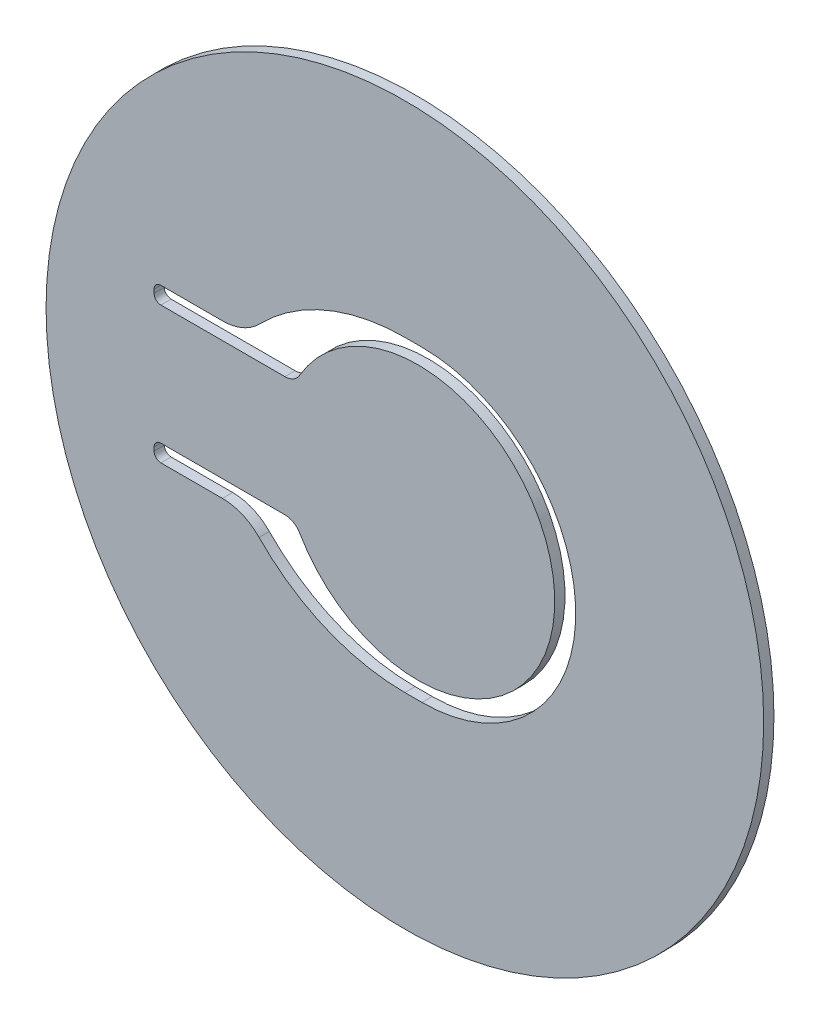
ISO-10303-21;
HEADER;
FILE_DESCRIPTION(('STEP AP214'),'2;1');
FILE_NAME('part.step','',(''),(''),'','','');
FILE_SCHEMA(('AUTOMOTIVE_DESIGN { 1 0 10303 214 1 1 1 1 }'));
ENDSEC;
DATA;
#1=APPLICATION_CONTEXT('core data for automotive mechanical design processes');
#2=APPLICATION_PROTOCOL_DEFINITION('international standard','automotive_design',2000,#1);
#3=PRODUCT_CONTEXT('',#1,'mechanical');
#4=PRODUCT('Part','Part','',(#3));
#5=PRODUCT_RELATED_PRODUCT_CATEGORY('part','',(#4));
#6=PRODUCT_DEFINITION_FORMATION('','',#4);
#7=PRODUCT_DEFINITION_CONTEXT('part definition',#1,'design');
#8=PRODUCT_DEFINITION('design','',#6,#7);
#9=PRODUCT_DEFINITION_SHAPE('','',#8);
#10=(LENGTH_UNIT() NAMED_UNIT(*) SI_UNIT(.MILLI.,.METRE.));
#11=(NAMED_UNIT(*) PLANE_ANGLE_UNIT() SI_UNIT($,.RADIAN.));
#12=(NAMED_UNIT(*) SI_UNIT($,.STERADIAN.) SOLID_ANGLE_UNIT());
#13=UNCERTAINTY_MEASURE_WITH_UNIT(LENGTH_MEASURE(1.E-05),#10,'distance_accuracy_value','');
#14=(GEOMETRIC_REPRESENTATION_CONTEXT(3) GLOBAL_UNCERTAINTY_ASSIGNED_CONTEXT((#13)) GLOBAL_UNIT_ASSIGNED_CONTEXT((#10,
#11,#12)) REPRESENTATION_CONTEXT('',''));
#15=CARTESIAN_POINT('',(0.,0.,0.));
#16=DIRECTION('',(0.,0.,1.));
#17=DIRECTION('',(1.,0.,0.));
#18=AXIS2_PLACEMENT_3D('',#15,#16,#17);
#19=CARTESIAN_POINT('',(0.,0.,-0.3));
#20=DIRECTION('',(0.,0.,1.));
#21=DIRECTION('',(1.,0.,0.));
#22=AXIS2_PLACEMENT_3D('',#19,#20,#21);
#23=CYLINDRICAL_SURFACE('',#22,10.5);
#24=CARTESIAN_POINT('',(0.,0.,-0.3));
#25=DIRECTION('',(0.,0.,1.));
#26=DIRECTION('',(1.,0.,0.));
#27=AXIS2_PLACEMENT_3D('',#24,#25,#26);
#28=CIRCLE('',#27,10.5);
#29=CARTESIAN_POINT('',(10.5,0.,-0.3));
#30=VERTEX_POINT('',#29);
#31=EDGE_CURVE('E11',#30,#30,#28,.T.);
#32=ORIENTED_EDGE('',*,*,#31,.T.);
#33=EDGE_LOOP('',(#32));
#34=FACE_BOUND('',#33,.T.);
#35=CARTESIAN_POINT('',(0.,0.,0.));
#36=DIRECTION('',(0.,0.,1.));
#37=DIRECTION('',(1.,0.,0.));
#38=AXIS2_PLACEMENT_3D('',#35,#36,#37);
#39=CIRCLE('',#38,10.5);
#40=CARTESIAN_POINT('',(10.5,0.,0.));
#41=VERTEX_POINT('',#40);
#42=EDGE_CURVE('E42',#41,#41,#39,.T.);
#43=ORIENTED_EDGE('',*,*,#42,.F.);
#44=EDGE_LOOP('',(#43));
#45=FACE_BOUND('',#44,.T.);
#46=ADVANCED_FACE('F39',(#34,#45),#23,.T.);
#47=CARTESIAN_POINT('',(0.,0.,-0.3));
#48=DIRECTION('',(0.,0.,1.));
#49=DIRECTION('',(1.,0.,0.));
#50=AXIS2_PLACEMENT_3D('',#47,#48,#49);
#51=PLANE('',#50);
#52=CARTESIAN_POINT('',(0.385934296614987,2.59592270811036E-11,-0.3));
#53=DIRECTION('',(0.,0.,-1.));
#54=DIRECTION('',(1.,0.,0.));
#55=AXIS2_PLACEMENT_3D('',#52,#53,#54);
#56=CIRCLE('',#55,4.);
#57=CARTESIAN_POINT('',(-3.07816731852943,2.00000000001442,-0.3));
#58=VERTEX_POINT('',#57);
#59=CARTESIAN_POINT('',(-3.07816731850944,-1.99999999999711,-0.3));
#60=VERTEX_POINT('',#59);
#61=EDGE_CURVE('E183',#58,#60,#56,.T.);
#62=ORIENTED_EDGE('',*,*,#61,.T.);
#63=CARTESIAN_POINT('',(-3.5111800204,-2.25,-0.3));
#64=DIRECTION('',(0.,0.,1.));
#65=DIRECTION('',(1.,0.,0.));
#66=AXIS2_PLACEMENT_3D('',#63,#64,#65);
#67=CIRCLE('',#66,0.500000000000001);
#68=CARTESIAN_POINT('',(-3.5111800204,-1.75,-0.3));
#69=VERTEX_POINT('',#68);
#70=EDGE_CURVE('E177',#60,#69,#67,.T.);
#71=ORIENTED_EDGE('',*,*,#70,.T.);
#72=DIRECTION('',(-1.,0.,0.));
#73=VECTOR('',#72,1.);
#74=CARTESIAN_POINT('',(-3.5111800204,-1.75,-0.3));
#75=LINE('',#74,#73);
#76=CARTESIAN_POINT('',(-7.1395785063,-1.75,-0.3));
#77=VERTEX_POINT('',#76);
#78=EDGE_CURVE('E186',#69,#77,#75,.T.);
#79=ORIENTED_EDGE('',*,*,#78,.T.);
#80=CARTESIAN_POINT('',(-7.1395785063,-1.95,-0.3));
#81=DIRECTION('',(0.,0.,1.));
#82=DIRECTION('',(1.,0.,0.));
#83=AXIS2_PLACEMENT_3D('',#80,#81,#82);
#84=CIRCLE('',#83,0.2);
#85=CARTESIAN_POINT('',(-7.3395785063,-1.95,-0.3));
#86=VERTEX_POINT('',#85);
#87=EDGE_CURVE('E53',#77,#86,#84,.T.);
#88=ORIENTED_EDGE('',*,*,#87,.T.);
#89=DIRECTION('',(0.,-1.,0.));
#90=VECTOR('',#89,1.);
#91=CARTESIAN_POINT('',(-7.3395785063,-1.95,-0.3));
#92=LINE('',#91,#90);
#93=CARTESIAN_POINT('',(-7.3395785063,-2.05,-0.3));
#94=VERTEX_POINT('',#93);
#95=EDGE_CURVE('E201',#86,#94,#92,.T.);
#96=ORIENTED_EDGE('',*,*,#95,.T.);
#97=CARTESIAN_POINT('',(-7.1395785063,-2.05,-0.3));
#98=DIRECTION('',(0.,0.,1.));
#99=DIRECTION('',(1.,0.,0.));
#100=AXIS2_PLACEMENT_3D('',#97,#98,#99);
#101=CIRCLE('',#100,0.2);
#102=CARTESIAN_POINT('',(-7.1395785063,-2.25,-0.3));
#103=VERTEX_POINT('',#102);
#104=EDGE_CURVE('E204',#94,#103,#101,.T.);
#105=ORIENTED_EDGE('',*,*,#104,.T.);
#106=DIRECTION('',(1.,0.,0.));
#107=VECTOR('',#106,1.);
#108=CARTESIAN_POINT('',(-7.1395785063,-2.25,-0.3));
#109=LINE('',#108,#107);
#110=CARTESIAN_POINT('',(-5.33957850633904,-2.25,-0.3));
#111=VERTEX_POINT('',#110);
#112=EDGE_CURVE('E207',#103,#111,#109,.T.);
#113=ORIENTED_EDGE('',*,*,#112,.T.);
#114=CARTESIAN_POINT('',(-5.33957850633904,-3.75,-0.3));
#115=DIRECTION('',(0.,0.,-1.));
#116=DIRECTION('',(1.,0.,0.));
#117=AXIS2_PLACEMENT_3D('',#114,#115,#116);
#118=CIRCLE('',#117,1.5);
#119=CARTESIAN_POINT('',(-4.26605179506636,-2.70236437623377,-0.3));
#120=VERTEX_POINT('',#119);
#121=EDGE_CURVE('E210',#111,#120,#118,.T.);
#122=ORIENTED_EDGE('',*,*,#121,.T.);
#123=CARTESIAN_POINT('',(0.,1.4607996945,-0.3));
#124=DIRECTION('',(0.,0.,1.));
#125=DIRECTION('',(1.,0.,0.));
#126=AXIS2_PLACEMENT_3D('',#123,#124,#125);
#127=CIRCLE('',#126,5.96079969450723);
#128=CARTESIAN_POINT('',(0.,-4.50000000000723,-0.3));
#129=VERTEX_POINT('',#128);
#130=EDGE_CURVE('E213',#120,#129,#127,.T.);
#131=ORIENTED_EDGE('',*,*,#130,.T.);
#132=DIRECTION('',(1.,0.,0.));
#133=VECTOR('',#132,1.);
#134=CARTESIAN_POINT('',(0.,-4.50000000000723,-0.3));
#135=LINE('',#134,#133);
#136=CARTESIAN_POINT('',(0.499999999999412,-4.50000000000723,-0.3));
#137=VERTEX_POINT('',#136);
#138=EDGE_CURVE('E216',#129,#137,#135,.T.);
#139=ORIENTED_EDGE('',*,*,#138,.T.);
#140=CARTESIAN_POINT('',(0.499999999999412,-5.7441031098282E-12,-0.3));
#141=DIRECTION('',(0.,0.,1.));
#142=DIRECTION('',(1.,0.,0.));
#143=AXIS2_PLACEMENT_3D('',#140,#141,#142);
#144=CIRCLE('',#143,4.50000000000149);
#145=CARTESIAN_POINT('',(0.499999999999412,4.49999999999574,-0.3));
#146=VERTEX_POINT('',#145);
#147=EDGE_CURVE('E219',#137,#146,#144,.T.);
#148=ORIENTED_EDGE('',*,*,#147,.T.);
#149=DIRECTION('',(-1.,0.,0.));
#150=VECTOR('',#149,1.);
#151=CARTESIAN_POINT('',(0.499999999999412,4.49999999999574,-0.3));
#152=LINE('',#151,#150);
#153=CARTESIAN_POINT('',(-8.29591863954499E-12,4.49999999999574,-0.3));
#154=VERTEX_POINT('',#153);
#155=EDGE_CURVE('E222',#146,#154,#152,.T.);
#156=ORIENTED_EDGE('',*,*,#155,.T.);
#157=CARTESIAN_POINT('',(-8.29591863954499E-12,-1.46079969449752,-0.3));
#158=DIRECTION('',(0.,0.,1.));
#159=DIRECTION('',(1.,0.,0.));
#160=AXIS2_PLACEMENT_3D('',#157,#158,#159);
#161=CIRCLE('',#160,5.96079969449326);
#162=CARTESIAN_POINT('',(-4.26605179504381,2.70236437624786,-0.3));
#163=VERTEX_POINT('',#162);
#164=EDGE_CURVE('E225',#154,#163,#161,.T.);
#165=ORIENTED_EDGE('',*,*,#164,.T.);
#166=CARTESIAN_POINT('',(-5.33957850631124,3.75000000001947,-0.3));
#167=DIRECTION('',(0.,0.,-1.));
#168=DIRECTION('',(1.,0.,0.));
#169=AXIS2_PLACEMENT_3D('',#166,#167,#168);
#170=CIRCLE('',#169,1.5);
#171=CARTESIAN_POINT('',(-5.33957850631124,2.25000000001947,-0.3));
#172=VERTEX_POINT('',#171);
#173=EDGE_CURVE('E228',#163,#172,#170,.T.);
#174=ORIENTED_EDGE('',*,*,#173,.T.);
#175=DIRECTION('',(-1.,0.,0.));
#176=VECTOR('',#175,1.);
#177=CARTESIAN_POINT('',(-5.33957850631124,2.25000000001947,-0.3));
#178=LINE('',#177,#176);
#179=CARTESIAN_POINT('',(-7.13957850631124,2.25000000001947,-0.3));
#180=VERTEX_POINT('',#179);
#181=EDGE_CURVE('E231',#172,#180,#178,.T.);
#182=ORIENTED_EDGE('',*,*,#181,.T.);
#183=CARTESIAN_POINT('',(-7.13957850631124,2.05000000001947,-0.3));
#184=DIRECTION('',(0.,0.,1.));
#185=DIRECTION('',(1.,0.,0.));
#186=AXIS2_PLACEMENT_3D('',#183,#184,#185);
#187=CIRCLE('',#186,0.200000000000001);
#188=CARTESIAN_POINT('',(-7.33957850631124,2.05000000001947,-0.3));
#189=VERTEX_POINT('',#188);
#190=EDGE_CURVE('E234',#180,#189,#187,.T.);
#191=ORIENTED_EDGE('',*,*,#190,.T.);
#192=DIRECTION('',(0.,-1.,0.));
#193=VECTOR('',#192,1.);
#194=CARTESIAN_POINT('',(-7.33957850631124,2.05000000001947,-0.3));
#195=LINE('',#194,#193);
#196=CARTESIAN_POINT('',(-7.33957850631124,1.95000000001947,-0.3));
#197=VERTEX_POINT('',#196);
#198=EDGE_CURVE('E237',#189,#197,#195,.T.);
#199=ORIENTED_EDGE('',*,*,#198,.T.);
#200=CARTESIAN_POINT('',(-7.13957850631124,1.95000000001947,-0.3));
#201=DIRECTION('',(0.,0.,1.));
#202=DIRECTION('',(1.,0.,0.));
#203=AXIS2_PLACEMENT_3D('',#200,#201,#202);
#204=CIRCLE('',#203,0.200000000000002);
#205=CARTESIAN_POINT('',(-7.13957850631124,1.75000000001947,-0.3));
#206=VERTEX_POINT('',#205);
#207=EDGE_CURVE('E240',#197,#206,#204,.T.);
#208=ORIENTED_EDGE('',*,*,#207,.T.);
#209=DIRECTION('',(1.,0.,0.));
#210=VECTOR('',#209,1.);
#211=CARTESIAN_POINT('',(-7.13957850631124,1.75000000001947,-0.3));
#212=LINE('',#211,#210);
#213=CARTESIAN_POINT('',(-3.51118002041123,1.75000000001947,-0.3));
#214=VERTEX_POINT('',#213);
#215=EDGE_CURVE('E243',#206,#214,#212,.T.);
#216=ORIENTED_EDGE('',*,*,#215,.T.);
#217=CARTESIAN_POINT('',(-3.51118002041124,2.25000000000649,-0.3));
#218=DIRECTION('',(0.,0.,1.));
#219=DIRECTION('',(1.,0.,0.));
#220=AXIS2_PLACEMENT_3D('',#217,#218,#219);
#221=CIRCLE('',#220,0.499999999987021);
#222=EDGE_CURVE('E246',#214,#58,#221,.T.);
#223=ORIENTED_EDGE('',*,*,#222,.T.);
#224=EDGE_LOOP('',(#62,#71,#79,#88,#96,#105,#113,#122,#131,#139,#148,#156,#165,#174,#182,#191,
#199,#208,#216,#223));
#225=FACE_BOUND('',#224,.T.);
#226=ORIENTED_EDGE('',*,*,#31,.F.);
#227=EDGE_LOOP('',(#226));
#228=FACE_BOUND('',#227,.T.);
#229=ADVANCED_FACE('F190',(#225,#228),#51,.F.);
#230=CARTESIAN_POINT('',(0.,0.,0.));
#231=DIRECTION('',(0.,0.,1.));
#232=DIRECTION('',(1.,0.,0.));
#233=AXIS2_PLACEMENT_3D('',#230,#231,#232);
#234=PLANE('',#233);
#235=CARTESIAN_POINT('',(-3.5111800204,-2.25,0.));
#236=DIRECTION('',(0.,0.,1.));
#237=DIRECTION('',(1.,0.,0.));
#238=AXIS2_PLACEMENT_3D('',#235,#236,#237);
#239=CIRCLE('',#238,0.500000000000001);
#240=CARTESIAN_POINT('',(-3.07816731850944,-1.99999999999711,0.));
#241=VERTEX_POINT('',#240);
#242=CARTESIAN_POINT('',(-3.5111800204,-1.75,0.));
#243=VERTEX_POINT('',#242);
#244=EDGE_CURVE('E61',#241,#243,#239,.T.);
#245=ORIENTED_EDGE('',*,*,#244,.F.);
#246=CARTESIAN_POINT('',(0.385934296614987,2.59592270811036E-11,0.));
#247=DIRECTION('',(0.,0.,-1.));
#248=DIRECTION('',(1.,0.,0.));
#249=AXIS2_PLACEMENT_3D('',#246,#247,#248);
#250=CIRCLE('',#249,4.);
#251=CARTESIAN_POINT('',(-3.07816731852943,2.00000000001442,0.));
#252=VERTEX_POINT('',#251);
#253=EDGE_CURVE('E194',#252,#241,#250,.T.);
#254=ORIENTED_EDGE('',*,*,#253,.F.);
#255=CARTESIAN_POINT('',(-3.51118002041124,2.25000000000649,0.));
#256=DIRECTION('',(0.,0.,1.));
#257=DIRECTION('',(1.,0.,0.));
#258=AXIS2_PLACEMENT_3D('',#255,#256,#257);
#259=CIRCLE('',#258,0.499999999987021);
#260=CARTESIAN_POINT('',(-3.51118002041123,1.75000000001947,0.));
#261=VERTEX_POINT('',#260);
#262=EDGE_CURVE('E197',#261,#252,#259,.T.);
#263=ORIENTED_EDGE('',*,*,#262,.F.);
#264=DIRECTION('',(1.,0.,0.));
#265=VECTOR('',#264,1.);
#266=CARTESIAN_POINT('',(-7.13957850631124,1.75000000001947,0.));
#267=LINE('',#266,#265);
#268=CARTESIAN_POINT('',(-7.13957850631124,1.75000000001947,0.));
#269=VERTEX_POINT('',#268);
#270=EDGE_CURVE('E297',#269,#261,#267,.T.);
#271=ORIENTED_EDGE('',*,*,#270,.F.);
#272=CARTESIAN_POINT('',(-7.13957850631124,1.95000000001947,0.));
#273=DIRECTION('',(0.,0.,1.));
#274=DIRECTION('',(1.,0.,0.));
#275=AXIS2_PLACEMENT_3D('',#272,#273,#274);
#276=CIRCLE('',#275,0.200000000000002);
#277=CARTESIAN_POINT('',(-7.33957850631124,1.95000000001947,0.));
#278=VERTEX_POINT('',#277);
#279=EDGE_CURVE('E294',#278,#269,#276,.T.);
#280=ORIENTED_EDGE('',*,*,#279,.F.);
#281=DIRECTION('',(0.,-1.,0.));
#282=VECTOR('',#281,1.);
#283=CARTESIAN_POINT('',(-7.33957850631124,2.05000000001947,0.));
#284=LINE('',#283,#282);
#285=CARTESIAN_POINT('',(-7.33957850631124,2.05000000001947,0.));
#286=VERTEX_POINT('',#285);
#287=EDGE_CURVE('E291',#286,#278,#284,.T.);
#288=ORIENTED_EDGE('',*,*,#287,.F.);
#289=CARTESIAN_POINT('',(-7.13957850631124,2.05000000001947,0.));
#290=DIRECTION('',(0.,0.,1.));
#291=DIRECTION('',(1.,0.,0.));
#292=AXIS2_PLACEMENT_3D('',#289,#290,#291);
#293=CIRCLE('',#292,0.200000000000001);
#294=CARTESIAN_POINT('',(-7.13957850631124,2.25000000001947,0.));
#295=VERTEX_POINT('',#294);
#296=EDGE_CURVE('E288',#295,#286,#293,.T.);
#297=ORIENTED_EDGE('',*,*,#296,.F.);
#298=DIRECTION('',(-1.,0.,0.));
#299=VECTOR('',#298,1.);
#300=CARTESIAN_POINT('',(-5.33957850631124,2.25000000001947,0.));
#301=LINE('',#300,#299);
#302=CARTESIAN_POINT('',(-5.33957850631124,2.25000000001947,0.));
#303=VERTEX_POINT('',#302);
#304=EDGE_CURVE('E285',#303,#295,#301,.T.);
#305=ORIENTED_EDGE('',*,*,#304,.F.);
#306=CARTESIAN_POINT('',(-5.33957850631124,3.75000000001947,0.));
#307=DIRECTION('',(0.,0.,-1.));
#308=DIRECTION('',(1.,0.,0.));
#309=AXIS2_PLACEMENT_3D('',#306,#307,#308);
#310=CIRCLE('',#309,1.5);
#311=CARTESIAN_POINT('',(-4.26605179504381,2.70236437624786,0.));
#312=VERTEX_POINT('',#311);
#313=EDGE_CURVE('E282',#312,#303,#310,.T.);
#314=ORIENTED_EDGE('',*,*,#313,.F.);
#315=CARTESIAN_POINT('',(-8.29591863954499E-12,-1.46079969449752,0.));
#316=DIRECTION('',(0.,0.,1.));
#317=DIRECTION('',(1.,0.,0.));
#318=AXIS2_PLACEMENT_3D('',#315,#316,#317);
#319=CIRCLE('',#318,5.96079969449326);
#320=CARTESIAN_POINT('',(-8.29591863954499E-12,4.49999999999574,0.));
#321=VERTEX_POINT('',#320);
#322=EDGE_CURVE('E279',#321,#312,#319,.T.);
#323=ORIENTED_EDGE('',*,*,#322,.F.);
#324=DIRECTION('',(-1.,0.,0.));
#325=VECTOR('',#324,1.);
#326=CARTESIAN_POINT('',(0.499999999999412,4.49999999999574,0.));
#327=LINE('',#326,#325);
#328=CARTESIAN_POINT('',(0.499999999999412,4.49999999999574,0.));
#329=VERTEX_POINT('',#328);
#330=EDGE_CURVE('E276',#329,#321,#327,.T.);
#331=ORIENTED_EDGE('',*,*,#330,.F.);
#332=CARTESIAN_POINT('',(0.499999999999412,-5.7441031098282E-12,0.));
#333=DIRECTION('',(0.,0.,1.));
#334=DIRECTION('',(1.,0.,0.));
#335=AXIS2_PLACEMENT_3D('',#332,#333,#334);
#336=CIRCLE('',#335,4.50000000000149);
#337=CARTESIAN_POINT('',(0.499999999999412,-4.50000000000723,0.));
#338=VERTEX_POINT('',#337);
#339=EDGE_CURVE('E273',#338,#329,#336,.T.);
#340=ORIENTED_EDGE('',*,*,#339,.F.);
#341=DIRECTION('',(1.,0.,0.));
#342=VECTOR('',#341,1.);
#343=CARTESIAN_POINT('',(0.,-4.50000000000723,0.));
#344=LINE('',#343,#342);
#345=CARTESIAN_POINT('',(0.,-4.50000000000723,0.));
#346=VERTEX_POINT('',#345);
#347=EDGE_CURVE('E270',#346,#338,#344,.T.);
#348=ORIENTED_EDGE('',*,*,#347,.F.);
#349=CARTESIAN_POINT('',(0.,1.4607996945,0.));
#350=DIRECTION('',(0.,0.,1.));
#351=DIRECTION('',(1.,0.,0.));
#352=AXIS2_PLACEMENT_3D('',#349,#350,#351);
#353=CIRCLE('',#352,5.96079969450723);
#354=CARTESIAN_POINT('',(-4.26605179506636,-2.70236437623377,0.));
#355=VERTEX_POINT('',#354);
#356=EDGE_CURVE('E267',#355,#346,#353,.T.);
#357=ORIENTED_EDGE('',*,*,#356,.F.);
#358=CARTESIAN_POINT('',(-5.33957850633904,-3.75,0.));
#359=DIRECTION('',(0.,0.,-1.));
#360=DIRECTION('',(1.,0.,0.));
#361=AXIS2_PLACEMENT_3D('',#358,#359,#360);
#362=CIRCLE('',#361,1.5);
#363=CARTESIAN_POINT('',(-5.33957850633904,-2.25,0.));
#364=VERTEX_POINT('',#363);
#365=EDGE_CURVE('E264',#364,#355,#362,.T.);
#366=ORIENTED_EDGE('',*,*,#365,.F.);
#367=DIRECTION('',(1.,0.,0.));
#368=VECTOR('',#367,1.);
#369=CARTESIAN_POINT('',(-7.1395785063,-2.25,0.));
#370=LINE('',#369,#368);
#371=CARTESIAN_POINT('',(-7.1395785063,-2.25,0.));
#372=VERTEX_POINT('',#371);
#373=EDGE_CURVE('E261',#372,#364,#370,.T.);
#374=ORIENTED_EDGE('',*,*,#373,.F.);
#375=CARTESIAN_POINT('',(-7.1395785063,-2.05,0.));
#376=DIRECTION('',(0.,0.,1.));
#377=DIRECTION('',(1.,0.,0.));
#378=AXIS2_PLACEMENT_3D('',#375,#376,#377);
#379=CIRCLE('',#378,0.2);
#380=CARTESIAN_POINT('',(-7.3395785063,-2.05,0.));
#381=VERTEX_POINT('',#380);
#382=EDGE_CURVE('E258',#381,#372,#379,.T.);
#383=ORIENTED_EDGE('',*,*,#382,.F.);
#384=DIRECTION('',(0.,-1.,0.));
#385=VECTOR('',#384,1.);
#386=CARTESIAN_POINT('',(-7.3395785063,-1.95,0.));
#387=LINE('',#386,#385);
#388=CARTESIAN_POINT('',(-7.3395785063,-1.95,0.));
#389=VERTEX_POINT('',#388);
#390=EDGE_CURVE('E255',#389,#381,#387,.T.);
#391=ORIENTED_EDGE('',*,*,#390,.F.);
#392=CARTESIAN_POINT('',(-7.1395785063,-1.95,0.));
#393=DIRECTION('',(0.,0.,1.));
#394=DIRECTION('',(1.,0.,0.));
#395=AXIS2_PLACEMENT_3D('',#392,#393,#394);
#396=CIRCLE('',#395,0.2);
#397=CARTESIAN_POINT('',(-7.1395785063,-1.75,0.));
#398=VERTEX_POINT('',#397);
#399=EDGE_CURVE('E252',#398,#389,#396,.T.);
#400=ORIENTED_EDGE('',*,*,#399,.F.);
#401=DIRECTION('',(-1.,0.,0.));
#402=VECTOR('',#401,1.);
#403=CARTESIAN_POINT('',(-3.5111800204,-1.75,0.));
#404=LINE('',#403,#402);
#405=EDGE_CURVE('E250',#243,#398,#404,.T.);
#406=ORIENTED_EDGE('',*,*,#405,.F.);
#407=EDGE_LOOP('',(#245,#254,#263,#271,#280,#288,#297,#305,#314,#323,#331,#340,#348,#357,#366,
#374,#383,#391,#400,#406));
#408=FACE_BOUND('',#407,.T.);
#409=ORIENTED_EDGE('',*,*,#42,.T.);
#410=EDGE_LOOP('',(#409));
#411=FACE_BOUND('',#410,.T.);
#412=ADVANCED_FACE('F342',(#408,#411),#234,.T.);
#413=CARTESIAN_POINT('',(-3.5111800204,-2.25,-0.3));
#414=DIRECTION('',(0.,0.,1.));
#415=DIRECTION('',(1.,0.,0.));
#416=AXIS2_PLACEMENT_3D('',#413,#414,#415);
#417=CYLINDRICAL_SURFACE('',#416,0.500000000000001);
#418=ORIENTED_EDGE('',*,*,#244,.T.);
#419=DIRECTION('',(0.,0.,1.));
#420=VECTOR('',#419,1.);
#421=CARTESIAN_POINT('',(-3.5111800204,-1.75,-0.3));
#422=LINE('',#421,#420);
#423=EDGE_CURVE('E173',#69,#243,#422,.T.);
#424=ORIENTED_EDGE('',*,*,#423,.F.);
#425=ORIENTED_EDGE('',*,*,#70,.F.);
#426=DIRECTION('',(0.,0.,1.));
#427=VECTOR('',#426,1.);
#428=CARTESIAN_POINT('',(-3.07816731850944,-1.99999999999711,-0.3));
#429=LINE('',#428,#427);
#430=EDGE_CURVE('E302',#60,#241,#429,.T.);
#431=ORIENTED_EDGE('',*,*,#430,.T.);
#432=EDGE_LOOP('',(#418,#424,#425,#431));
#433=FACE_BOUND('',#432,.T.);
#434=ADVANCED_FACE('F175',(#433),#417,.F.);
#435=CARTESIAN_POINT('',(0.385934296614987,2.59592270811036E-11,-0.3));
#436=DIRECTION('',(0.,0.,1.));
#437=DIRECTION('',(1.,0.,0.));
#438=AXIS2_PLACEMENT_3D('',#435,#436,#437);
#439=CYLINDRICAL_SURFACE('',#438,4.);
#440=ORIENTED_EDGE('',*,*,#253,.T.);
#441=ORIENTED_EDGE('',*,*,#430,.F.);
#442=ORIENTED_EDGE('',*,*,#61,.F.);
#443=DIRECTION('',(0.,0.,1.));
#444=VECTOR('',#443,1.);
#445=CARTESIAN_POINT('',(-3.07816731852943,2.00000000001442,-0.3));
#446=LINE('',#445,#444);
#447=EDGE_CURVE('E304',#58,#252,#446,.T.);
#448=ORIENTED_EDGE('',*,*,#447,.T.);
#449=EDGE_LOOP('',(#440,#441,#442,#448));
#450=FACE_BOUND('',#449,.T.);
#451=ADVANCED_FACE('F409',(#450),#439,.T.);
#452=CARTESIAN_POINT('',(-3.51118002041124,2.25000000000649,-0.3));
#453=DIRECTION('',(0.,0.,1.));
#454=DIRECTION('',(1.,0.,0.));
#455=AXIS2_PLACEMENT_3D('',#452,#453,#454);
#456=CYLINDRICAL_SURFACE('',#455,0.499999999987021);
#457=ORIENTED_EDGE('',*,*,#262,.T.);
#458=ORIENTED_EDGE('',*,*,#447,.F.);
#459=ORIENTED_EDGE('',*,*,#222,.F.);
#460=DIRECTION('',(0.,0.,1.));
#461=VECTOR('',#460,1.);
#462=CARTESIAN_POINT('',(-3.51118002041123,1.75000000001947,-0.3));
#463=LINE('',#462,#461);
#464=EDGE_CURVE('E306',#214,#261,#463,.T.);
#465=ORIENTED_EDGE('',*,*,#464,.T.);
#466=EDGE_LOOP('',(#457,#458,#459,#465));
#467=FACE_BOUND('',#466,.T.);
#468=ADVANCED_FACE('F406',(#467),#456,.F.);
#469=CARTESIAN_POINT('',(-7.13957850631124,1.75000000001947,-0.3));
#470=DIRECTION('',(0.,-1.,0.));
#471=DIRECTION('',(0.,0.,-1.));
#472=AXIS2_PLACEMENT_3D('',#469,#470,#471);
#473=PLANE('',#472);
#474=ORIENTED_EDGE('',*,*,#270,.T.);
#475=ORIENTED_EDGE('',*,*,#464,.F.);
#476=ORIENTED_EDGE('',*,*,#215,.F.);
#477=DIRECTION('',(0.,0.,1.));
#478=VECTOR('',#477,1.);
#479=CARTESIAN_POINT('',(-7.13957850631124,1.75000000001947,-0.3));
#480=LINE('',#479,#478);
#481=EDGE_CURVE('E308',#206,#269,#480,.T.);
#482=ORIENTED_EDGE('',*,*,#481,.T.);
#483=EDGE_LOOP('',(#474,#475,#476,#482));
#484=FACE_BOUND('',#483,.T.);
#485=ADVANCED_FACE('F402',(#484),#473,.F.);
#486=CARTESIAN_POINT('',(-7.13957850631124,1.95000000001947,-0.3));
#487=DIRECTION('',(0.,0.,1.));
#488=DIRECTION('',(1.,0.,0.));
#489=AXIS2_PLACEMENT_3D('',#486,#487,#488);
#490=CYLINDRICAL_SURFACE('',#489,0.200000000000002);
#491=ORIENTED_EDGE('',*,*,#279,.T.);
#492=ORIENTED_EDGE('',*,*,#481,.F.);
#493=ORIENTED_EDGE('',*,*,#207,.F.);
#494=DIRECTION('',(0.,0.,1.));
#495=VECTOR('',#494,1.);
#496=CARTESIAN_POINT('',(-7.33957850631124,1.95000000001947,-0.3));
#497=LINE('',#496,#495);
#498=EDGE_CURVE('E310',#197,#278,#497,.T.);
#499=ORIENTED_EDGE('',*,*,#498,.T.);
#500=EDGE_LOOP('',(#491,#492,#493,#499));
#501=FACE_BOUND('',#500,.T.);
#502=ADVANCED_FACE('F398',(#501),#490,.F.);
#503=CARTESIAN_POINT('',(-7.33957850631124,2.05000000001947,-0.3));
#504=DIRECTION('',(-1.,0.,0.));
#505=DIRECTION('',(0.,0.,1.));
#506=AXIS2_PLACEMENT_3D('',#503,#504,#505);
#507=PLANE('',#506);
#508=ORIENTED_EDGE('',*,*,#287,.T.);
#509=ORIENTED_EDGE('',*,*,#498,.F.);
#510=ORIENTED_EDGE('',*,*,#198,.F.);
#511=DIRECTION('',(0.,0.,1.));
#512=VECTOR('',#511,1.);
#513=CARTESIAN_POINT('',(-7.33957850631124,2.05000000001947,-0.3));
#514=LINE('',#513,#512);
#515=EDGE_CURVE('E312',#189,#286,#514,.T.);
#516=ORIENTED_EDGE('',*,*,#515,.T.);
#517=EDGE_LOOP('',(#508,#509,#510,#516));
#518=FACE_BOUND('',#517,.T.);
#519=ADVANCED_FACE('F394',(#518),#507,.F.);
#520=CARTESIAN_POINT('',(-7.13957850631124,2.05000000001947,-0.3));
#521=DIRECTION('',(0.,0.,1.));
#522=DIRECTION('',(1.,0.,0.));
#523=AXIS2_PLACEMENT_3D('',#520,#521,#522);
#524=CYLINDRICAL_SURFACE('',#523,0.200000000000001);
#525=ORIENTED_EDGE('',*,*,#296,.T.);
#526=ORIENTED_EDGE('',*,*,#515,.F.);
#527=ORIENTED_EDGE('',*,*,#190,.F.);
#528=DIRECTION('',(0.,0.,1.));
#529=VECTOR('',#528,1.);
#530=CARTESIAN_POINT('',(-7.13957850631124,2.25000000001947,-0.3));
#531=LINE('',#530,#529);
#532=EDGE_CURVE('E314',#180,#295,#531,.T.);
#533=ORIENTED_EDGE('',*,*,#532,.T.);
#534=EDGE_LOOP('',(#525,#526,#527,#533));
#535=FACE_BOUND('',#534,.T.);
#536=ADVANCED_FACE('F390',(#535),#524,.F.);
#537=CARTESIAN_POINT('',(-5.33957850631124,2.25000000001947,-0.3));
#538=DIRECTION('',(0.,1.,0.));
#539=DIRECTION('',(0.,0.,1.));
#540=AXIS2_PLACEMENT_3D('',#537,#538,#539);
#541=PLANE('',#540);
#542=ORIENTED_EDGE('',*,*,#304,.T.);
#543=ORIENTED_EDGE('',*,*,#532,.F.);
#544=ORIENTED_EDGE('',*,*,#181,.F.);
#545=DIRECTION('',(0.,0.,1.));
#546=VECTOR('',#545,1.);
#547=CARTESIAN_POINT('',(-5.33957850631124,2.25000000001947,-0.3));
#548=LINE('',#547,#546);
#549=EDGE_CURVE('E316',#172,#303,#548,.T.);
#550=ORIENTED_EDGE('',*,*,#549,.T.);
#551=EDGE_LOOP('',(#542,#543,#544,#550));
#552=FACE_BOUND('',#551,.T.);
#553=ADVANCED_FACE('F386',(#552),#541,.F.);
#554=CARTESIAN_POINT('',(-5.33957850631124,3.75000000001947,-0.3));
#555=DIRECTION('',(0.,0.,1.));
#556=DIRECTION('',(1.,0.,0.));
#557=AXIS2_PLACEMENT_3D('',#554,#555,#556);
#558=CYLINDRICAL_SURFACE('',#557,1.5);
#559=ORIENTED_EDGE('',*,*,#313,.T.);
#560=ORIENTED_EDGE('',*,*,#549,.F.);
#561=ORIENTED_EDGE('',*,*,#173,.F.);
#562=DIRECTION('',(0.,0.,1.));
#563=VECTOR('',#562,1.);
#564=CARTESIAN_POINT('',(-4.26605179504381,2.70236437624786,-0.3));
#565=LINE('',#564,#563);
#566=EDGE_CURVE('E318',#163,#312,#565,.T.);
#567=ORIENTED_EDGE('',*,*,#566,.T.);
#568=EDGE_LOOP('',(#559,#560,#561,#567));
#569=FACE_BOUND('',#568,.T.);
#570=ADVANCED_FACE('F382',(#569),#558,.T.);
#571=CARTESIAN_POINT('',(-8.29591863954499E-12,-1.46079969449752,-0.3));
#572=DIRECTION('',(0.,0.,1.));
#573=DIRECTION('',(1.,0.,0.));
#574=AXIS2_PLACEMENT_3D('',#571,#572,#573);
#575=CYLINDRICAL_SURFACE('',#574,5.96079969449326);
#576=ORIENTED_EDGE('',*,*,#322,.T.);
#577=ORIENTED_EDGE('',*,*,#566,.F.);
#578=ORIENTED_EDGE('',*,*,#164,.F.);
#579=DIRECTION('',(0.,0.,1.));
#580=VECTOR('',#579,1.);
#581=CARTESIAN_POINT('',(-8.29591863954499E-12,4.49999999999574,-0.3));
#582=LINE('',#581,#580);
#583=EDGE_CURVE('E320',#154,#321,#582,.T.);
#584=ORIENTED_EDGE('',*,*,#583,.T.);
#585=EDGE_LOOP('',(#576,#577,#578,#584));
#586=FACE_BOUND('',#585,.T.);
#587=ADVANCED_FACE('F378',(#586),#575,.F.);
#588=CARTESIAN_POINT('',(0.499999999999412,4.49999999999574,-0.3));
#589=DIRECTION('',(0.,1.,0.));
#590=DIRECTION('',(-1.,0.,0.));
#591=AXIS2_PLACEMENT_3D('',#588,#589,#590);
#592=PLANE('',#591);
#593=ORIENTED_EDGE('',*,*,#330,.T.);
#594=ORIENTED_EDGE('',*,*,#583,.F.);
#595=ORIENTED_EDGE('',*,*,#155,.F.);
#596=DIRECTION('',(0.,0.,1.));
#597=VECTOR('',#596,1.);
#598=CARTESIAN_POINT('',(0.499999999999412,4.49999999999574,-0.3));
#599=LINE('',#598,#597);
#600=EDGE_CURVE('E322',#146,#329,#599,.T.);
#601=ORIENTED_EDGE('',*,*,#600,.T.);
#602=EDGE_LOOP('',(#593,#594,#595,#601));
#603=FACE_BOUND('',#602,.T.);
#604=ADVANCED_FACE('F374',(#603),#592,.F.);
#605=CARTESIAN_POINT('',(0.499999999999412,-5.7441031098282E-12,-0.3));
#606=DIRECTION('',(0.,0.,1.));
#607=DIRECTION('',(1.,0.,0.));
#608=AXIS2_PLACEMENT_3D('',#605,#606,#607);
#609=CYLINDRICAL_SURFACE('',#608,4.50000000000149);
#610=ORIENTED_EDGE('',*,*,#339,.T.);
#611=ORIENTED_EDGE('',*,*,#600,.F.);
#612=ORIENTED_EDGE('',*,*,#147,.F.);
#613=DIRECTION('',(0.,0.,1.));
#614=VECTOR('',#613,1.);
#615=CARTESIAN_POINT('',(0.499999999999412,-4.50000000000723,-0.3));
#616=LINE('',#615,#614);
#617=EDGE_CURVE('E324',#137,#338,#616,.T.);
#618=ORIENTED_EDGE('',*,*,#617,.T.);
#619=EDGE_LOOP('',(#610,#611,#612,#618));
#620=FACE_BOUND('',#619,.T.);
#621=ADVANCED_FACE('F370',(#620),#609,.F.);
#622=CARTESIAN_POINT('',(0.,-4.50000000000723,-0.3));
#623=DIRECTION('',(0.,-1.,0.));
#624=DIRECTION('',(1.,0.,0.));
#625=AXIS2_PLACEMENT_3D('',#622,#623,#624);
#626=PLANE('',#625);
#627=ORIENTED_EDGE('',*,*,#347,.T.);
#628=ORIENTED_EDGE('',*,*,#617,.F.);
#629=ORIENTED_EDGE('',*,*,#138,.F.);
#630=DIRECTION('',(0.,0.,1.));
#631=VECTOR('',#630,1.);
#632=CARTESIAN_POINT('',(0.,-4.50000000000723,-0.3));
#633=LINE('',#632,#631);
#634=EDGE_CURVE('E326',#129,#346,#633,.T.);
#635=ORIENTED_EDGE('',*,*,#634,.T.);
#636=EDGE_LOOP('',(#627,#628,#629,#635));
#637=FACE_BOUND('',#636,.T.);
#638=ADVANCED_FACE('F366',(#637),#626,.F.);
#639=CARTESIAN_POINT('',(0.,1.4607996945,-0.3));
#640=DIRECTION('',(0.,0.,1.));
#641=DIRECTION('',(1.,0.,0.));
#642=AXIS2_PLACEMENT_3D('',#639,#640,#641);
#643=CYLINDRICAL_SURFACE('',#642,5.96079969450723);
#644=ORIENTED_EDGE('',*,*,#356,.T.);
#645=ORIENTED_EDGE('',*,*,#634,.F.);
#646=ORIENTED_EDGE('',*,*,#130,.F.);
#647=DIRECTION('',(0.,0.,1.));
#648=VECTOR('',#647,1.);
#649=CARTESIAN_POINT('',(-4.26605179506636,-2.70236437623377,-0.3));
#650=LINE('',#649,#648);
#651=EDGE_CURVE('E328',#120,#355,#650,.T.);
#652=ORIENTED_EDGE('',*,*,#651,.T.);
#653=EDGE_LOOP('',(#644,#645,#646,#652));
#654=FACE_BOUND('',#653,.T.);
#655=ADVANCED_FACE('F362',(#654),#643,.F.);
#656=CARTESIAN_POINT('',(-5.33957850633904,-3.75,-0.3));
#657=DIRECTION('',(0.,0.,1.));
#658=DIRECTION('',(1.,0.,0.));
#659=AXIS2_PLACEMENT_3D('',#656,#657,#658);
#660=CYLINDRICAL_SURFACE('',#659,1.5);
#661=ORIENTED_EDGE('',*,*,#365,.T.);
#662=ORIENTED_EDGE('',*,*,#651,.F.);
#663=ORIENTED_EDGE('',*,*,#121,.F.);
#664=DIRECTION('',(0.,0.,1.));
#665=VECTOR('',#664,1.);
#666=CARTESIAN_POINT('',(-5.33957850633904,-2.25,-0.3));
#667=LINE('',#666,#665);
#668=EDGE_CURVE('E330',#111,#364,#667,.T.);
#669=ORIENTED_EDGE('',*,*,#668,.T.);
#670=EDGE_LOOP('',(#661,#662,#663,#669));
#671=FACE_BOUND('',#670,.T.);
#672=ADVANCED_FACE('F358',(#671),#660,.T.);
#673=CARTESIAN_POINT('',(-7.1395785063,-2.25,-0.3));
#674=DIRECTION('',(0.,-1.,0.));
#675=DIRECTION('',(0.,0.,-1.));
#676=AXIS2_PLACEMENT_3D('',#673,#674,#675);
#677=PLANE('',#676);
#678=ORIENTED_EDGE('',*,*,#373,.T.);
#679=ORIENTED_EDGE('',*,*,#668,.F.);
#680=ORIENTED_EDGE('',*,*,#112,.F.);
#681=DIRECTION('',(0.,0.,1.));
#682=VECTOR('',#681,1.);
#683=CARTESIAN_POINT('',(-7.1395785063,-2.25,-0.3));
#684=LINE('',#683,#682);
#685=EDGE_CURVE('E332',#103,#372,#684,.T.);
#686=ORIENTED_EDGE('',*,*,#685,.T.);
#687=EDGE_LOOP('',(#678,#679,#680,#686));
#688=FACE_BOUND('',#687,.T.);
#689=ADVANCED_FACE('F354',(#688),#677,.F.);
#690=CARTESIAN_POINT('',(-7.1395785063,-2.05,-0.3));
#691=DIRECTION('',(0.,0.,1.));
#692=DIRECTION('',(1.,0.,0.));
#693=AXIS2_PLACEMENT_3D('',#690,#691,#692);
#694=CYLINDRICAL_SURFACE('',#693,0.2);
#695=ORIENTED_EDGE('',*,*,#382,.T.);
#696=ORIENTED_EDGE('',*,*,#685,.F.);
#697=ORIENTED_EDGE('',*,*,#104,.F.);
#698=DIRECTION('',(0.,0.,1.));
#699=VECTOR('',#698,1.);
#700=CARTESIAN_POINT('',(-7.3395785063,-2.05,-0.3));
#701=LINE('',#700,#699);
#702=EDGE_CURVE('E334',#94,#381,#701,.T.);
#703=ORIENTED_EDGE('',*,*,#702,.T.);
#704=EDGE_LOOP('',(#695,#696,#697,#703));
#705=FACE_BOUND('',#704,.T.);
#706=ADVANCED_FACE('F352',(#705),#694,.F.);
#707=CARTESIAN_POINT('',(-7.3395785063,-1.95,-0.3));
#708=DIRECTION('',(-1.,0.,0.));
#709=DIRECTION('',(0.,0.,1.));
#710=AXIS2_PLACEMENT_3D('',#707,#708,#709);
#711=PLANE('',#710);
#712=ORIENTED_EDGE('',*,*,#390,.T.);
#713=ORIENTED_EDGE('',*,*,#702,.F.);
#714=ORIENTED_EDGE('',*,*,#95,.F.);
#715=DIRECTION('',(0.,0.,1.));
#716=VECTOR('',#715,1.);
#717=CARTESIAN_POINT('',(-7.3395785063,-1.95,-0.3));
#718=LINE('',#717,#716);
#719=EDGE_CURVE('E336',#86,#389,#718,.T.);
#720=ORIENTED_EDGE('',*,*,#719,.T.);
#721=EDGE_LOOP('',(#712,#713,#714,#720));
#722=FACE_BOUND('',#721,.T.);
#723=ADVANCED_FACE('F347',(#722),#711,.F.);
#724=CARTESIAN_POINT('',(-7.1395785063,-1.95,-0.3));
#725=DIRECTION('',(0.,0.,1.));
#726=DIRECTION('',(1.,0.,0.));
#727=AXIS2_PLACEMENT_3D('',#724,#725,#726);
#728=CYLINDRICAL_SURFACE('',#727,0.2);
#729=ORIENTED_EDGE('',*,*,#399,.T.);
#730=ORIENTED_EDGE('',*,*,#719,.F.);
#731=ORIENTED_EDGE('',*,*,#87,.F.);
#732=DIRECTION('',(0.,0.,1.));
#733=VECTOR('',#732,1.);
#734=CARTESIAN_POINT('',(-7.1395785063,-1.75,-0.3));
#735=LINE('',#734,#733);
#736=EDGE_CURVE('E182',#77,#398,#735,.T.);
#737=ORIENTED_EDGE('',*,*,#736,.T.);
#738=EDGE_LOOP('',(#729,#730,#731,#737));
#739=FACE_BOUND('',#738,.T.);
#740=ADVANCED_FACE('F338',(#739),#728,.F.);
#741=CARTESIAN_POINT('',(-3.5111800204,-1.75,-0.3));
#742=DIRECTION('',(0.,1.,0.));
#743=DIRECTION('',(-1.,0.,0.));
#744=AXIS2_PLACEMENT_3D('',#741,#742,#743);
#745=PLANE('',#744);
#746=ORIENTED_EDGE('',*,*,#405,.T.);
#747=ORIENTED_EDGE('',*,*,#736,.F.);
#748=ORIENTED_EDGE('',*,*,#78,.F.);
#749=ORIENTED_EDGE('',*,*,#423,.T.);
#750=EDGE_LOOP('',(#746,#747,#748,#749));
#751=FACE_BOUND('',#750,.T.);
#752=ADVANCED_FACE('F187',(#751),#745,.F.);
#753=CLOSED_SHELL('',(#46,#229,#412,#434,#451,#468,#485,#502,#519,#536,#553,#570,#587,#604,#621,
#638,#655,#672,#689,#706,#723,#740,#752));
#754=MANIFOLD_SOLID_BREP('B2',#753);
#755=ADVANCED_BREP_SHAPE_REPRESENTATION('',(#18,#754),#14);
#756=SHAPE_DEFINITION_REPRESENTATION(#9,#755);
ENDSEC;
END-ISO-10303-21;
